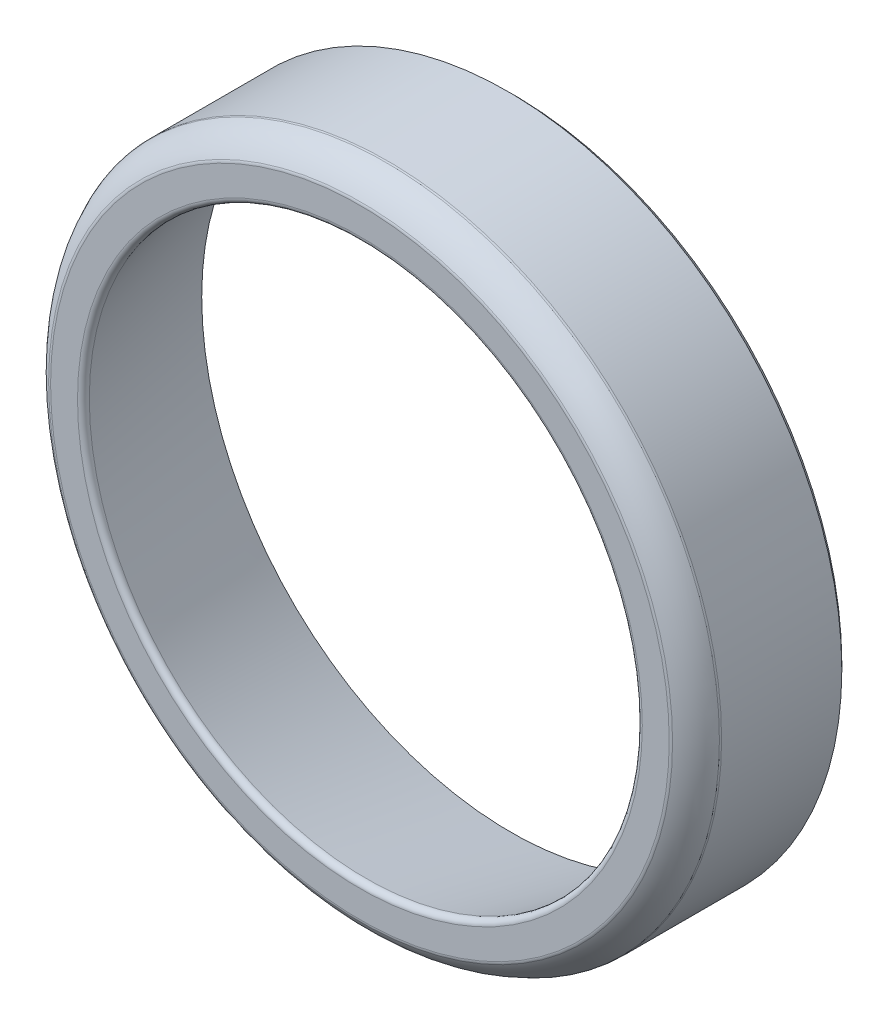
ISO-10303-21;
HEADER;
FILE_DESCRIPTION(('STEP AP214'),'2;1');
FILE_NAME('part.step','',(''),(''),'','','');
FILE_SCHEMA(('AUTOMOTIVE_DESIGN { 1 0 10303 214 1 1 1 1 }'));
ENDSEC;
DATA;
#1=APPLICATION_CONTEXT('core data for automotive mechanical design processes');
#2=APPLICATION_PROTOCOL_DEFINITION('international standard','automotive_design',2000,#1);
#3=PRODUCT_CONTEXT('',#1,'mechanical');
#4=PRODUCT('Part','Part','',(#3));
#5=PRODUCT_RELATED_PRODUCT_CATEGORY('part','',(#4));
#6=PRODUCT_DEFINITION_FORMATION('','',#4);
#7=PRODUCT_DEFINITION_CONTEXT('part definition',#1,'design');
#8=PRODUCT_DEFINITION('design','',#6,#7);
#9=PRODUCT_DEFINITION_SHAPE('','',#8);
#10=(LENGTH_UNIT() NAMED_UNIT(*) SI_UNIT(.MILLI.,.METRE.));
#11=(NAMED_UNIT(*) PLANE_ANGLE_UNIT() SI_UNIT($,.RADIAN.));
#12=(NAMED_UNIT(*) SI_UNIT($,.STERADIAN.) SOLID_ANGLE_UNIT());
#13=UNCERTAINTY_MEASURE_WITH_UNIT(LENGTH_MEASURE(1.E-05),#10,'distance_accuracy_value','');
#14=(GEOMETRIC_REPRESENTATION_CONTEXT(3) GLOBAL_UNCERTAINTY_ASSIGNED_CONTEXT((#13)) GLOBAL_UNIT_ASSIGNED_CONTEXT((#10,
#11,#12)) REPRESENTATION_CONTEXT('',''));
#15=CARTESIAN_POINT('',(0.,0.,0.));
#16=DIRECTION('',(0.,0.,1.));
#17=DIRECTION('',(1.,0.,0.));
#18=AXIS2_PLACEMENT_3D('',#15,#16,#17);
#19=CARTESIAN_POINT('',(404.767707802093,621.555740703895,0.244107073346871));
#20=DIRECTION('',(0.,0.,-1.));
#21=DIRECTION('',(-1.,0.,0.));
#22=AXIS2_PLACEMENT_3D('',#19,#20,#21);
#23=CONICAL_SURFACE('',#22,28.6960394890497,1.00295228138542);
#24=CARTESIAN_POINT('',(404.767707802093,621.555740703895,0.244107073346891));
#25=DIRECTION('',(0.,0.,-1.));
#26=DIRECTION('',(1.,0.,0.));
#27=AXIS2_PLACEMENT_3D('',#24,#25,#26);
#28=CIRCLE('',#27,28.6960394890496);
#29=CARTESIAN_POINT('',(433.463747291143,621.555740703895,0.244107073346891));
#30=VERTEX_POINT('',#29);
#31=EDGE_CURVE('E91',#30,#30,#28,.T.);
#32=ORIENTED_EDGE('',*,*,#31,.F.);
#33=EDGE_LOOP('',(#32));
#34=FACE_BOUND('',#33,.T.);
#35=CARTESIAN_POINT('',(404.767707802093,621.555740703895,0.));
#36=DIRECTION('',(0.,0.,1.));
#37=DIRECTION('',(1.,0.,0.));
#38=AXIS2_PLACEMENT_3D('',#35,#36,#37);
#39=CIRCLE('',#38,29.078693820242);
#40=CARTESIAN_POINT('',(433.846401622335,621.555740703895,0.));
#41=VERTEX_POINT('',#40);
#42=EDGE_CURVE('E54',#41,#41,#39,.T.);
#43=ORIENTED_EDGE('',*,*,#42,.F.);
#44=EDGE_LOOP('',(#43));
#45=FACE_BOUND('',#44,.T.);
#46=ADVANCED_FACE('F44',(#34,#45),#23,.F.);
#47=CARTESIAN_POINT('',(404.767707802093,621.555740703895,0.));
#48=DIRECTION('',(0.,0.,1.));
#49=DIRECTION('',(1.,0.,0.));
#50=AXIS2_PLACEMENT_3D('',#47,#48,#49);
#51=CONICAL_SURFACE('',#50,30.5,0.7853981625);
#52=CARTESIAN_POINT('',(404.767707802093,621.555740703895,0.));
#53=DIRECTION('',(0.,0.,-1.));
#54=DIRECTION('',(1.,0.,0.));
#55=AXIS2_PLACEMENT_3D('',#52,#53,#54);
#56=CIRCLE('',#55,30.5);
#57=CARTESIAN_POINT('',(435.267707802093,621.555740703895,0.));
#58=VERTEX_POINT('',#57);
#59=EDGE_CURVE('E11',#58,#58,#56,.T.);
#60=ORIENTED_EDGE('',*,*,#59,.F.);
#61=EDGE_LOOP('',(#60));
#62=FACE_BOUND('',#61,.T.);
#63=CARTESIAN_POINT('',(404.767707802093,621.555740703895,0.5));
#64=DIRECTION('',(0.,0.,1.));
#65=DIRECTION('',(1.,0.,0.));
#66=AXIS2_PLACEMENT_3D('',#63,#64,#65);
#67=CIRCLE('',#66,31.);
#68=CARTESIAN_POINT('',(435.767707802093,621.555740703895,0.5));
#69=VERTEX_POINT('',#68);
#70=EDGE_CURVE('E77',#69,#69,#67,.T.);
#71=ORIENTED_EDGE('',*,*,#70,.F.);
#72=EDGE_LOOP('',(#71));
#73=FACE_BOUND('',#72,.T.);
#74=ADVANCED_FACE('F115',(#62,#73),#51,.T.);
#75=CARTESIAN_POINT('',(404.767707802093,621.555740703895,13.75));
#76=DIRECTION('',(0.,0.,-1.));
#77=DIRECTION('',(-1.,0.,0.));
#78=AXIS2_PLACEMENT_3D('',#75,#76,#77);
#79=TOROIDAL_SURFACE('',#78,26.222596688377,0.5);
#80=CARTESIAN_POINT('',(404.767707802093,621.555740703895,14.25));
#81=DIRECTION('',(0.,0.,-1.));
#82=DIRECTION('',(-1.,0.,0.));
#83=AXIS2_PLACEMENT_3D('',#80,#81,#82);
#84=CIRCLE('',#83,26.222596688377);
#85=CARTESIAN_POINT('',(378.545111113716,621.555740703895,14.25));
#86=VERTEX_POINT('',#85);
#87=EDGE_CURVE('E87',#86,#86,#84,.T.);
#88=ORIENTED_EDGE('',*,*,#87,.F.);
#89=EDGE_LOOP('',(#88));
#90=FACE_BOUND('',#89,.T.);
#91=CARTESIAN_POINT('',(404.767707802093,621.555740703895,13.6420789780993));
#92=DIRECTION('',(0.,0.,1.));
#93=DIRECTION('',(1.,0.,0.));
#94=AXIS2_PLACEMENT_3D('',#91,#92,#93);
#95=CIRCLE('',#94,25.7343825416833);
#96=CARTESIAN_POINT('',(430.502090343777,621.555740703895,13.6420789780993));
#97=VERTEX_POINT('',#96);
#98=EDGE_CURVE('E88',#97,#97,#95,.T.);
#99=ORIENTED_EDGE('',*,*,#98,.F.);
#100=EDGE_LOOP('',(#99));
#101=FACE_BOUND('',#100,.T.);
#102=ADVANCED_FACE('F106',(#90,#101),#79,.T.);
#103=CARTESIAN_POINT('',(404.767707802093,621.555740703895,13.75));
#104=DIRECTION('',(0.,0.,-1.));
#105=DIRECTION('',(-1.,0.,0.));
#106=AXIS2_PLACEMENT_3D('',#103,#104,#105);
#107=TOROIDAL_SURFACE('',#106,28.7223229201311,0.5);
#108=CARTESIAN_POINT('',(404.767707802093,621.555740703895,14.1850198703899));
#109=DIRECTION('',(0.,0.,-1.));
#110=DIRECTION('',(-1.,0.,0.));
#111=AXIS2_PLACEMENT_3D('',#108,#109,#110);
#112=CIRCLE('',#111,28.9688137158334);
#113=CARTESIAN_POINT('',(375.79889408626,621.555740703895,14.1850198703899));
#114=VERTEX_POINT('',#113);
#115=EDGE_CURVE('E84',#114,#114,#112,.T.);
#116=ORIENTED_EDGE('',*,*,#115,.F.);
#117=EDGE_LOOP('',(#116));
#118=FACE_BOUND('',#117,.T.);
#119=CARTESIAN_POINT('',(404.767707802093,621.555740703895,14.25));
#120=DIRECTION('',(0.,0.,1.));
#121=DIRECTION('',(-1.,0.,0.));
#122=AXIS2_PLACEMENT_3D('',#119,#120,#121);
#123=CIRCLE('',#122,28.7223229201311);
#124=CARTESIAN_POINT('',(376.045384881962,621.555740703895,14.25));
#125=VERTEX_POINT('',#124);
#126=EDGE_CURVE('E48',#125,#125,#123,.T.);
#127=ORIENTED_EDGE('',*,*,#126,.F.);
#128=EDGE_LOOP('',(#127));
#129=FACE_BOUND('',#128,.T.);
#130=ADVANCED_FACE('F104',(#118,#129),#107,.T.);
#131=CARTESIAN_POINT('',(404.767707802093,621.555740703895,11.6628500108611));
#132=DIRECTION('',(0.,0.,1.));
#133=DIRECTION('',(1.,0.,0.));
#134=AXIS2_PLACEMENT_3D('',#131,#132,#133);
#135=TOROIDAL_SURFACE('',#134,30.5,0.5);
#136=CARTESIAN_POINT('',(404.767707802093,621.555740703895,11.6628500108611));
#137=DIRECTION('',(0.,0.,-1.));
#138=DIRECTION('',(1.,0.,0.));
#139=AXIS2_PLACEMENT_3D('',#136,#137,#138);
#140=CIRCLE('',#139,31.);
#141=CARTESIAN_POINT('',(435.767707802093,621.555740703895,11.6628500108611));
#142=VERTEX_POINT('',#141);
#143=EDGE_CURVE('E80',#142,#142,#140,.T.);
#144=ORIENTED_EDGE('',*,*,#143,.F.);
#145=EDGE_LOOP('',(#144));
#146=FACE_BOUND('',#145,.T.);
#147=CARTESIAN_POINT('',(404.767707802093,621.555740703895,11.8369761326086));
#148=DIRECTION('',(0.,0.,1.));
#149=DIRECTION('',(-1.,0.,0.));
#150=AXIS2_PLACEMENT_3D('',#147,#148,#149);
#151=CIRCLE('',#150,30.9687004306859);
#152=CARTESIAN_POINT('',(373.799007371407,621.555740703895,11.8369761326086));
#153=VERTEX_POINT('',#152);
#154=EDGE_CURVE('E81',#153,#153,#151,.T.);
#155=ORIENTED_EDGE('',*,*,#154,.F.);
#156=EDGE_LOOP('',(#155));
#157=FACE_BOUND('',#156,.T.);
#158=ADVANCED_FACE('F46',(#146,#157),#135,.T.);
#159=CARTESIAN_POINT('',(373.767707802093,621.555740703895,0.));
#160=DIRECTION('',(0.,0.,1.));
#161=DIRECTION('',(1.,0.,0.));
#162=AXIS2_PLACEMENT_3D('',#159,#160,#161);
#163=PLANE('',#162);
#164=ORIENTED_EDGE('',*,*,#59,.T.);
#165=EDGE_LOOP('',(#164));
#166=FACE_BOUND('',#165,.T.);
#167=ORIENTED_EDGE('',*,*,#42,.T.);
#168=EDGE_LOOP('',(#167));
#169=FACE_BOUND('',#168,.T.);
#170=ADVANCED_FACE('F113',(#166,#169),#163,.F.);
#171=CARTESIAN_POINT('',(404.767707802093,621.555740703895,0.));
#172=DIRECTION('',(0.,0.,-1.));
#173=DIRECTION('',(-1.,0.,0.));
#174=AXIS2_PLACEMENT_3D('',#171,#172,#173);
#175=CONICAL_SURFACE('',#174,28.75,0.217554118885417);
#176=ORIENTED_EDGE('',*,*,#98,.T.);
#177=EDGE_LOOP('',(#176));
#178=FACE_BOUND('',#177,.T.);
#179=ORIENTED_EDGE('',*,*,#31,.T.);
#180=EDGE_LOOP('',(#179));
#181=FACE_BOUND('',#180,.T.);
#182=ADVANCED_FACE('F133',(#178,#181),#175,.F.);
#183=CARTESIAN_POINT('',(379.167707802093,621.555740703895,14.25));
#184=DIRECTION('',(0.,0.,-1.));
#185=DIRECTION('',(-1.,0.,0.));
#186=AXIS2_PLACEMENT_3D('',#183,#184,#185);
#187=PLANE('',#186);
#188=ORIENTED_EDGE('',*,*,#126,.T.);
#189=EDGE_LOOP('',(#188));
#190=FACE_BOUND('',#189,.T.);
#191=ORIENTED_EDGE('',*,*,#87,.T.);
#192=EDGE_LOOP('',(#191));
#193=FACE_BOUND('',#192,.T.);
#194=ADVANCED_FACE('F102',(#190,#193),#187,.F.);
#195=CARTESIAN_POINT('',(404.767707802093,621.555740703895,10.2698410368809));
#196=DIRECTION('',(0.,0.,-1.));
#197=DIRECTION('',(-1.,0.,0.));
#198=AXIS2_PLACEMENT_3D('',#195,#196,#197);
#199=TOROIDAL_SURFACE('',#198,26.7503965545127,4.5);
#200=ORIENTED_EDGE('',*,*,#115,.T.);
#201=EDGE_LOOP('',(#200));
#202=FACE_BOUND('',#201,.T.);
#203=ORIENTED_EDGE('',*,*,#154,.T.);
#204=EDGE_LOOP('',(#203));
#205=FACE_BOUND('',#204,.T.);
#206=ADVANCED_FACE('F132',(#202,#205),#199,.T.);
#207=CARTESIAN_POINT('',(404.767707802093,621.555740703895,0.));
#208=DIRECTION('',(0.,0.,-1.));
#209=DIRECTION('',(-1.,0.,0.));
#210=AXIS2_PLACEMENT_3D('',#207,#208,#209);
#211=CYLINDRICAL_SURFACE('',#210,31.);
#212=ORIENTED_EDGE('',*,*,#143,.T.);
#213=EDGE_LOOP('',(#212));
#214=FACE_BOUND('',#213,.T.);
#215=ORIENTED_EDGE('',*,*,#70,.T.);
#216=EDGE_LOOP('',(#215));
#217=FACE_BOUND('',#216,.T.);
#218=ADVANCED_FACE('F78',(#214,#217),#211,.T.);
#219=CLOSED_SHELL('',(#46,#74,#102,#130,#158,#170,#182,#194,#206,#218));
#220=MANIFOLD_SOLID_BREP('B2',#219);
#221=ADVANCED_BREP_SHAPE_REPRESENTATION('',(#18,#220),#14);
#222=SHAPE_DEFINITION_REPRESENTATION(#9,#221);
ENDSEC;
END-ISO-10303-21;
